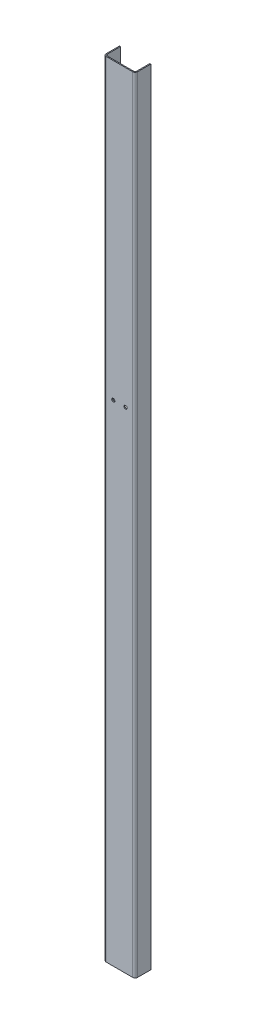
ISO-10303-21;
HEADER;
FILE_DESCRIPTION(('STEP AP214'),'2;1');
FILE_NAME('part.step','',(''),(''),'','','');
FILE_SCHEMA(('AUTOMOTIVE_DESIGN { 1 0 10303 214 1 1 1 1 }'));
ENDSEC;
DATA;
#1=APPLICATION_CONTEXT('core data for automotive mechanical design processes');
#2=APPLICATION_PROTOCOL_DEFINITION('international standard','automotive_design',2000,#1);
#3=PRODUCT_CONTEXT('',#1,'mechanical');
#4=PRODUCT('Part','Part','',(#3));
#5=PRODUCT_RELATED_PRODUCT_CATEGORY('part','',(#4));
#6=PRODUCT_DEFINITION_FORMATION('','',#4);
#7=PRODUCT_DEFINITION_CONTEXT('part definition',#1,'design');
#8=PRODUCT_DEFINITION('design','',#6,#7);
#9=PRODUCT_DEFINITION_SHAPE('','',#8);
#10=(LENGTH_UNIT() NAMED_UNIT(*) SI_UNIT(.MILLI.,.METRE.));
#11=(NAMED_UNIT(*) PLANE_ANGLE_UNIT() SI_UNIT($,.RADIAN.));
#12=(NAMED_UNIT(*) SI_UNIT($,.STERADIAN.) SOLID_ANGLE_UNIT());
#13=UNCERTAINTY_MEASURE_WITH_UNIT(LENGTH_MEASURE(1.E-05),#10,'distance_accuracy_value','');
#14=(GEOMETRIC_REPRESENTATION_CONTEXT(3) GLOBAL_UNCERTAINTY_ASSIGNED_CONTEXT((#13)) GLOBAL_UNIT_ASSIGNED_CONTEXT((#10,
#11,#12)) REPRESENTATION_CONTEXT('',''));
#15=CARTESIAN_POINT('',(0.,0.,0.));
#16=DIRECTION('',(0.,0.,1.));
#17=DIRECTION('',(1.,0.,0.));
#18=AXIS2_PLACEMENT_3D('',#15,#16,#17);
#19=CARTESIAN_POINT('',(-32.,800.,-30.));
#20=DIRECTION('',(1.,0.,0.));
#21=DIRECTION('',(0.,0.,-1.));
#22=AXIS2_PLACEMENT_3D('',#19,#20,#21);
#23=PLANE('',#22);
#24=CARTESIAN_POINT('',(-32.,350.,-14.9999999999999));
#25=DIRECTION('',(-1.,0.,0.));
#26=DIRECTION('',(0.,0.,1.));
#27=AXIS2_PLACEMENT_3D('',#24,#25,#26);
#28=CIRCLE('',#27,2.74999999999997);
#29=CARTESIAN_POINT('',(-32.,350.,-12.2499999999999));
#30=VERTEX_POINT('',#29);
#31=EDGE_CURVE('E291',#30,#30,#28,.T.);
#32=ORIENTED_EDGE('',*,*,#31,.F.);
#33=EDGE_LOOP('',(#32));
#34=FACE_BOUND('',#33,.T.);
#35=CARTESIAN_POINT('',(-32.,0.,-15.));
#36=DIRECTION('',(-1.,0.,0.));
#37=DIRECTION('',(0.,0.,1.));
#38=AXIS2_PLACEMENT_3D('',#35,#36,#37);
#39=CIRCLE('',#38,2.74999999999999);
#40=CARTESIAN_POINT('',(-32.,0.,-12.25));
#41=VERTEX_POINT('',#40);
#42=EDGE_CURVE('E285',#41,#41,#39,.T.);
#43=ORIENTED_EDGE('',*,*,#42,.F.);
#44=EDGE_LOOP('',(#43));
#45=FACE_BOUND('',#44,.T.);
#46=CARTESIAN_POINT('',(-32.,-350.,-14.9999999999999));
#47=DIRECTION('',(-1.,0.,0.));
#48=DIRECTION('',(0.,0.,1.));
#49=AXIS2_PLACEMENT_3D('',#46,#47,#48);
#50=CIRCLE('',#49,2.74999999999997);
#51=CARTESIAN_POINT('',(-32.,-350.,-12.2499999999999));
#52=VERTEX_POINT('',#51);
#53=EDGE_CURVE('E279',#52,#52,#50,.T.);
#54=ORIENTED_EDGE('',*,*,#53,.F.);
#55=EDGE_LOOP('',(#54));
#56=FACE_BOUND('',#55,.T.);
#57=CARTESIAN_POINT('',(-32.,-700.,-14.9999999999999));
#58=DIRECTION('',(-1.,0.,0.));
#59=DIRECTION('',(0.,0.,1.));
#60=AXIS2_PLACEMENT_3D('',#57,#58,#59);
#61=CIRCLE('',#60,2.75000000000003);
#62=CARTESIAN_POINT('',(-32.,-700.,-12.2499999999998));
#63=VERTEX_POINT('',#62);
#64=EDGE_CURVE('E273',#63,#63,#61,.T.);
#65=ORIENTED_EDGE('',*,*,#64,.F.);
#66=EDGE_LOOP('',(#65));
#67=FACE_BOUND('',#66,.T.);
#68=DIRECTION('',(0.,0.,1.));
#69=VECTOR('',#68,1.);
#70=CARTESIAN_POINT('',(-32.,-800.,-30.));
#71=LINE('',#70,#69);
#72=CARTESIAN_POINT('',(-32.,-800.,-30.));
#73=VERTEX_POINT('',#72);
#74=CARTESIAN_POINT('',(-32.,-800.,-3.00000000000003));
#75=VERTEX_POINT('',#74);
#76=EDGE_CURVE('E198',#73,#75,#71,.T.);
#77=ORIENTED_EDGE('',*,*,#76,.T.);
#78=DIRECTION('',(0.,-1.,0.));
#79=VECTOR('',#78,1.);
#80=CARTESIAN_POINT('',(-32.,800.,-3.00000000000003));
#81=LINE('',#80,#79);
#82=CARTESIAN_POINT('',(-32.,800.,-3.00000000000003));
#83=VERTEX_POINT('',#82);
#84=EDGE_CURVE('E163',#83,#75,#81,.T.);
#85=ORIENTED_EDGE('',*,*,#84,.F.);
#86=DIRECTION('',(0.,0.,1.));
#87=VECTOR('',#86,1.);
#88=CARTESIAN_POINT('',(-32.,800.,-30.));
#89=LINE('',#88,#87);
#90=CARTESIAN_POINT('',(-32.,800.,-30.));
#91=VERTEX_POINT('',#90);
#92=EDGE_CURVE('E154',#91,#83,#89,.T.);
#93=ORIENTED_EDGE('',*,*,#92,.F.);
#94=DIRECTION('',(0.,-1.,0.));
#95=VECTOR('',#94,1.);
#96=CARTESIAN_POINT('',(-32.,800.,-30.));
#97=LINE('',#96,#95);
#98=EDGE_CURVE('E210',#91,#73,#97,.T.);
#99=ORIENTED_EDGE('',*,*,#98,.T.);
#100=EDGE_LOOP('',(#77,#85,#93,#99));
#101=FACE_BOUND('',#100,.T.);
#102=CARTESIAN_POINT('',(-32.,700.,-14.9999999999999));
#103=DIRECTION('',(-1.,0.,0.));
#104=DIRECTION('',(0.,0.,1.));
#105=AXIS2_PLACEMENT_3D('',#102,#103,#104);
#106=CIRCLE('',#105,2.75000000000003);
#107=CARTESIAN_POINT('',(-32.,700.,-12.2499999999998));
#108=VERTEX_POINT('',#107);
#109=EDGE_CURVE('E297',#108,#108,#106,.T.);
#110=ORIENTED_EDGE('',*,*,#109,.F.);
#111=EDGE_LOOP('',(#110));
#112=FACE_BOUND('',#111,.T.);
#113=ADVANCED_FACE('F39',(#34,#45,#56,#67,#101,#112),#23,.F.);
#114=CARTESIAN_POINT('',(-27.,800.,0.));
#115=DIRECTION('',(0.,1.,0.));
#116=DIRECTION('',(0.,0.,1.));
#117=AXIS2_PLACEMENT_3D('',#114,#115,#116);
#118=PLANE('',#117);
#119=DIRECTION('',(0.,0.,1.));
#120=VECTOR('',#119,1.);
#121=CARTESIAN_POINT('',(-27.,800.,0.));
#122=LINE('',#121,#120);
#123=CARTESIAN_POINT('',(-27.,800.,0.));
#124=VERTEX_POINT('',#123);
#125=CARTESIAN_POINT('',(-27.,800.,2.));
#126=VERTEX_POINT('',#125);
#127=EDGE_CURVE('E11',#124,#126,#122,.T.);
#128=ORIENTED_EDGE('',*,*,#127,.F.);
#129=CARTESIAN_POINT('',(-27.,800.,-3.));
#130=DIRECTION('',(0.,1.,0.));
#131=DIRECTION('',(0.,0.,1.));
#132=AXIS2_PLACEMENT_3D('',#129,#130,#131);
#133=CIRCLE('',#132,3.);
#134=CARTESIAN_POINT('',(-30.,800.,-3.00000000000002));
#135=VERTEX_POINT('',#134);
#136=EDGE_CURVE('E251',#135,#124,#133,.T.);
#137=ORIENTED_EDGE('',*,*,#136,.F.);
#138=DIRECTION('',(1.,0.,0.));
#139=VECTOR('',#138,1.);
#140=CARTESIAN_POINT('',(-32.,800.,-3.00000000000003));
#141=LINE('',#140,#139);
#142=EDGE_CURVE('E48',#83,#135,#141,.T.);
#143=ORIENTED_EDGE('',*,*,#142,.F.);
#144=CARTESIAN_POINT('',(-27.,800.,-3.));
#145=DIRECTION('',(0.,1.,0.));
#146=DIRECTION('',(1.,0.,0.));
#147=AXIS2_PLACEMENT_3D('',#144,#145,#146);
#148=CIRCLE('',#147,5.);
#149=EDGE_CURVE('E149',#83,#126,#148,.T.);
#150=ORIENTED_EDGE('',*,*,#149,.T.);
#151=EDGE_LOOP('',(#128,#137,#143,#150));
#152=FACE_BOUND('',#151,.T.);
#153=ADVANCED_FACE('F41',(#152),#118,.T.);
#154=CARTESIAN_POINT('',(-32.,800.,-3.00000000000003));
#155=DIRECTION('',(0.,1.,0.));
#156=DIRECTION('',(0.,0.,1.));
#157=AXIS2_PLACEMENT_3D('',#154,#155,#156);
#158=PLANE('',#157);
#159=DIRECTION('',(1.,0.,0.));
#160=VECTOR('',#159,1.);
#161=CARTESIAN_POINT('',(-27.,800.,0.));
#162=LINE('',#161,#160);
#163=CARTESIAN_POINT('',(27.,800.,0.));
#164=VERTEX_POINT('',#163);
#165=EDGE_CURVE('E143',#124,#164,#162,.T.);
#166=ORIENTED_EDGE('',*,*,#165,.F.);
#167=ORIENTED_EDGE('',*,*,#127,.T.);
#168=DIRECTION('',(1.,0.,0.));
#169=VECTOR('',#168,1.);
#170=CARTESIAN_POINT('',(-27.,800.,2.));
#171=LINE('',#170,#169);
#172=CARTESIAN_POINT('',(27.,800.,1.99999999999999));
#173=VERTEX_POINT('',#172);
#174=EDGE_CURVE('E140',#126,#173,#171,.T.);
#175=ORIENTED_EDGE('',*,*,#174,.T.);
#176=DIRECTION('',(0.,0.,-1.));
#177=VECTOR('',#176,1.);
#178=CARTESIAN_POINT('',(27.,800.,1.99999999999999));
#179=LINE('',#178,#177);
#180=EDGE_CURVE('E232',#173,#164,#179,.T.);
#181=ORIENTED_EDGE('',*,*,#180,.T.);
#182=EDGE_LOOP('',(#166,#167,#175,#181));
#183=FACE_BOUND('',#182,.T.);
#184=ADVANCED_FACE('F138',(#183),#158,.T.);
#185=CARTESIAN_POINT('',(-30.,-800.,-3.00000000000002));
#186=DIRECTION('',(0.,-1.,0.));
#187=DIRECTION('',(0.,0.,-1.));
#188=AXIS2_PLACEMENT_3D('',#185,#186,#187);
#189=PLANE('',#188);
#190=DIRECTION('',(-1.,0.,0.));
#191=VECTOR('',#190,1.);
#192=CARTESIAN_POINT('',(-30.,-800.,-3.00000000000002));
#193=LINE('',#192,#191);
#194=CARTESIAN_POINT('',(-30.,-800.,-3.00000000000002));
#195=VERTEX_POINT('',#194);
#196=EDGE_CURVE('E237',#195,#75,#193,.T.);
#197=ORIENTED_EDGE('',*,*,#196,.F.);
#198=CARTESIAN_POINT('',(-27.,-800.,-3.));
#199=DIRECTION('',(0.,1.,0.));
#200=DIRECTION('',(0.,0.,1.));
#201=AXIS2_PLACEMENT_3D('',#198,#199,#200);
#202=CIRCLE('',#201,3.);
#203=CARTESIAN_POINT('',(-27.,-800.,0.));
#204=VERTEX_POINT('',#203);
#205=EDGE_CURVE('E189',#195,#204,#202,.T.);
#206=ORIENTED_EDGE('',*,*,#205,.T.);
#207=DIRECTION('',(0.,0.,-1.));
#208=VECTOR('',#207,1.);
#209=CARTESIAN_POINT('',(-27.,-800.,2.));
#210=LINE('',#209,#208);
#211=CARTESIAN_POINT('',(-27.,-800.,2.));
#212=VERTEX_POINT('',#211);
#213=EDGE_CURVE('E235',#212,#204,#210,.T.);
#214=ORIENTED_EDGE('',*,*,#213,.F.);
#215=CARTESIAN_POINT('',(-27.,-800.,-3.));
#216=DIRECTION('',(0.,1.,0.));
#217=DIRECTION('',(1.,0.,0.));
#218=AXIS2_PLACEMENT_3D('',#215,#216,#217);
#219=CIRCLE('',#218,5.);
#220=EDGE_CURVE('E161',#75,#212,#219,.T.);
#221=ORIENTED_EDGE('',*,*,#220,.F.);
#222=EDGE_LOOP('',(#197,#206,#214,#221));
#223=FACE_BOUND('',#222,.T.);
#224=ADVANCED_FACE('F326',(#223),#189,.T.);
#225=CARTESIAN_POINT('',(-27.,-800.,2.));
#226=DIRECTION('',(0.,-1.,0.));
#227=DIRECTION('',(0.,0.,-1.));
#228=AXIS2_PLACEMENT_3D('',#225,#226,#227);
#229=PLANE('',#228);
#230=DIRECTION('',(0.,0.,1.));
#231=VECTOR('',#230,1.);
#232=CARTESIAN_POINT('',(-30.,-800.,-30.));
#233=LINE('',#232,#231);
#234=CARTESIAN_POINT('',(-30.,-800.,-30.));
#235=VERTEX_POINT('',#234);
#236=EDGE_CURVE('E192',#235,#195,#233,.T.);
#237=ORIENTED_EDGE('',*,*,#236,.T.);
#238=ORIENTED_EDGE('',*,*,#196,.T.);
#239=ORIENTED_EDGE('',*,*,#76,.F.);
#240=DIRECTION('',(1.,0.,0.));
#241=VECTOR('',#240,1.);
#242=CARTESIAN_POINT('',(-32.,-800.,-30.));
#243=LINE('',#242,#241);
#244=EDGE_CURVE('E195',#73,#235,#243,.T.);
#245=ORIENTED_EDGE('',*,*,#244,.T.);
#246=EDGE_LOOP('',(#237,#238,#239,#245));
#247=FACE_BOUND('',#246,.T.);
#248=ADVANCED_FACE('F329',(#247),#229,.T.);
#249=CARTESIAN_POINT('',(30.,800.,-3.00000000000003));
#250=DIRECTION('',(0.,1.,0.));
#251=DIRECTION('',(0.,0.,1.));
#252=AXIS2_PLACEMENT_3D('',#249,#250,#251);
#253=PLANE('',#252);
#254=DIRECTION('',(1.,0.,0.));
#255=VECTOR('',#254,1.);
#256=CARTESIAN_POINT('',(30.,800.,-3.00000000000003));
#257=LINE('',#256,#255);
#258=CARTESIAN_POINT('',(30.,800.,-3.00000000000003));
#259=VERTEX_POINT('',#258);
#260=CARTESIAN_POINT('',(32.,800.,-3.00000000000003));
#261=VERTEX_POINT('',#260);
#262=EDGE_CURVE('E56',#259,#261,#257,.T.);
#263=ORIENTED_EDGE('',*,*,#262,.F.);
#264=CARTESIAN_POINT('',(27.,800.,-3.00000000000001));
#265=DIRECTION('',(0.,1.,0.));
#266=DIRECTION('',(0.,0.,1.));
#267=AXIS2_PLACEMENT_3D('',#264,#265,#266);
#268=CIRCLE('',#267,3.);
#269=EDGE_CURVE('E261',#164,#259,#268,.T.);
#270=ORIENTED_EDGE('',*,*,#269,.F.);
#271=ORIENTED_EDGE('',*,*,#180,.F.);
#272=CARTESIAN_POINT('',(27.,800.,-3.00000000000001));
#273=DIRECTION('',(0.,1.,0.));
#274=DIRECTION('',(1.,0.,0.));
#275=AXIS2_PLACEMENT_3D('',#272,#273,#274);
#276=CIRCLE('',#275,5.);
#277=EDGE_CURVE('E169',#173,#261,#276,.T.);
#278=ORIENTED_EDGE('',*,*,#277,.T.);
#279=EDGE_LOOP('',(#263,#270,#271,#278));
#280=FACE_BOUND('',#279,.T.);
#281=ADVANCED_FACE('F534',(#280),#253,.T.);
#282=CARTESIAN_POINT('',(27.,800.,1.99999999999999));
#283=DIRECTION('',(0.,1.,0.));
#284=DIRECTION('',(0.,0.,1.));
#285=AXIS2_PLACEMENT_3D('',#282,#283,#284);
#286=PLANE('',#285);
#287=DIRECTION('',(0.,0.,-1.));
#288=VECTOR('',#287,1.);
#289=CARTESIAN_POINT('',(30.,800.,-3.00000000000003));
#290=LINE('',#289,#288);
#291=CARTESIAN_POINT('',(30.,800.,-30.));
#292=VERTEX_POINT('',#291);
#293=EDGE_CURVE('E264',#259,#292,#290,.T.);
#294=ORIENTED_EDGE('',*,*,#293,.F.);
#295=ORIENTED_EDGE('',*,*,#262,.T.);
#296=DIRECTION('',(0.,0.,-1.));
#297=VECTOR('',#296,1.);
#298=CARTESIAN_POINT('',(32.,800.,-3.00000000000003));
#299=LINE('',#298,#297);
#300=CARTESIAN_POINT('',(32.,800.,-30.));
#301=VERTEX_POINT('',#300);
#302=EDGE_CURVE('E110',#261,#301,#299,.T.);
#303=ORIENTED_EDGE('',*,*,#302,.T.);
#304=DIRECTION('',(1.,0.,0.));
#305=VECTOR('',#304,1.);
#306=CARTESIAN_POINT('',(30.,800.,-30.));
#307=LINE('',#306,#305);
#308=EDGE_CURVE('E267',#292,#301,#307,.T.);
#309=ORIENTED_EDGE('',*,*,#308,.F.);
#310=EDGE_LOOP('',(#294,#295,#303,#309));
#311=FACE_BOUND('',#310,.T.);
#312=ADVANCED_FACE('F524',(#311),#286,.T.);
#313=CARTESIAN_POINT('',(27.,-800.,0.));
#314=DIRECTION('',(0.,-1.,0.));
#315=DIRECTION('',(0.,0.,-1.));
#316=AXIS2_PLACEMENT_3D('',#313,#314,#315);
#317=PLANE('',#316);
#318=DIRECTION('',(0.,0.,1.));
#319=VECTOR('',#318,1.);
#320=CARTESIAN_POINT('',(27.,-800.,0.));
#321=LINE('',#320,#319);
#322=CARTESIAN_POINT('',(27.,-800.,0.));
#323=VERTEX_POINT('',#322);
#324=CARTESIAN_POINT('',(27.,-800.,1.99999999999999));
#325=VERTEX_POINT('',#324);
#326=EDGE_CURVE('E97',#323,#325,#321,.T.);
#327=ORIENTED_EDGE('',*,*,#326,.F.);
#328=CARTESIAN_POINT('',(27.,-800.,-3.00000000000001));
#329=DIRECTION('',(0.,1.,0.));
#330=DIRECTION('',(0.,0.,1.));
#331=AXIS2_PLACEMENT_3D('',#328,#329,#330);
#332=CIRCLE('',#331,3.);
#333=CARTESIAN_POINT('',(30.,-800.,-3.00000000000003));
#334=VERTEX_POINT('',#333);
#335=EDGE_CURVE('E185',#323,#334,#332,.T.);
#336=ORIENTED_EDGE('',*,*,#335,.T.);
#337=DIRECTION('',(-1.,0.,0.));
#338=VECTOR('',#337,1.);
#339=CARTESIAN_POINT('',(32.,-800.,-3.00000000000003));
#340=LINE('',#339,#338);
#341=CARTESIAN_POINT('',(32.,-800.,-3.00000000000003));
#342=VERTEX_POINT('',#341);
#343=EDGE_CURVE('E104',#342,#334,#340,.T.);
#344=ORIENTED_EDGE('',*,*,#343,.F.);
#345=CARTESIAN_POINT('',(27.,-800.,-3.00000000000001));
#346=DIRECTION('',(0.,1.,0.));
#347=DIRECTION('',(1.,0.,0.));
#348=AXIS2_PLACEMENT_3D('',#345,#346,#347);
#349=CIRCLE('',#348,5.);
#350=EDGE_CURVE('E204',#325,#342,#349,.T.);
#351=ORIENTED_EDGE('',*,*,#350,.F.);
#352=EDGE_LOOP('',(#327,#336,#344,#351));
#353=FACE_BOUND('',#352,.T.);
#354=ADVANCED_FACE('F514',(#353),#317,.T.);
#355=CARTESIAN_POINT('',(32.,-800.,-3.00000000000003));
#356=DIRECTION('',(0.,-1.,0.));
#357=DIRECTION('',(0.,0.,-1.));
#358=AXIS2_PLACEMENT_3D('',#355,#356,#357);
#359=PLANE('',#358);
#360=DIRECTION('',(1.,0.,0.));
#361=VECTOR('',#360,1.);
#362=CARTESIAN_POINT('',(-27.,-800.,0.));
#363=LINE('',#362,#361);
#364=EDGE_CURVE('E187',#204,#323,#363,.T.);
#365=ORIENTED_EDGE('',*,*,#364,.T.);
#366=ORIENTED_EDGE('',*,*,#326,.T.);
#367=DIRECTION('',(1.,0.,0.));
#368=VECTOR('',#367,1.);
#369=CARTESIAN_POINT('',(-27.,-800.,2.));
#370=LINE('',#369,#368);
#371=EDGE_CURVE('E202',#212,#325,#370,.T.);
#372=ORIENTED_EDGE('',*,*,#371,.F.);
#373=ORIENTED_EDGE('',*,*,#213,.T.);
#374=EDGE_LOOP('',(#365,#366,#372,#373));
#375=FACE_BOUND('',#374,.T.);
#376=ADVANCED_FACE('F503',(#375),#359,.T.);
#377=CARTESIAN_POINT('',(32.,800.,-3.00000000000003));
#378=DIRECTION('',(-1.,0.,0.));
#379=DIRECTION('',(0.,0.,1.));
#380=AXIS2_PLACEMENT_3D('',#377,#378,#379);
#381=PLANE('',#380);
#382=DIRECTION('',(0.,0.,-1.));
#383=VECTOR('',#382,1.);
#384=CARTESIAN_POINT('',(32.,-800.,-3.00000000000003));
#385=LINE('',#384,#383);
#386=CARTESIAN_POINT('',(32.,-800.,-30.));
#387=VERTEX_POINT('',#386);
#388=EDGE_CURVE('E175',#342,#387,#385,.T.);
#389=ORIENTED_EDGE('',*,*,#388,.T.);
#390=DIRECTION('',(0.,-1.,0.));
#391=VECTOR('',#390,1.);
#392=CARTESIAN_POINT('',(32.,800.,-30.));
#393=LINE('',#392,#391);
#394=EDGE_CURVE('E228',#301,#387,#393,.T.);
#395=ORIENTED_EDGE('',*,*,#394,.F.);
#396=ORIENTED_EDGE('',*,*,#302,.F.);
#397=DIRECTION('',(0.,-1.,0.));
#398=VECTOR('',#397,1.);
#399=CARTESIAN_POINT('',(32.,800.,-3.00000000000003));
#400=LINE('',#399,#398);
#401=EDGE_CURVE('E171',#261,#342,#400,.T.);
#402=ORIENTED_EDGE('',*,*,#401,.T.);
#403=EDGE_LOOP('',(#389,#395,#396,#402));
#404=FACE_BOUND('',#403,.T.);
#405=ADVANCED_FACE('F492',(#404),#381,.F.);
#406=CARTESIAN_POINT('',(30.,800.,-30.));
#407=DIRECTION('',(0.,0.,-1.));
#408=DIRECTION('',(-1.,0.,0.));
#409=AXIS2_PLACEMENT_3D('',#406,#407,#408);
#410=PLANE('',#409);
#411=DIRECTION('',(1.,0.,0.));
#412=VECTOR('',#411,1.);
#413=CARTESIAN_POINT('',(30.,-800.,-30.));
#414=LINE('',#413,#412);
#415=CARTESIAN_POINT('',(30.,-800.,-30.));
#416=VERTEX_POINT('',#415);
#417=EDGE_CURVE('E178',#416,#387,#414,.T.);
#418=ORIENTED_EDGE('',*,*,#417,.F.);
#419=DIRECTION('',(0.,-1.,0.));
#420=VECTOR('',#419,1.);
#421=CARTESIAN_POINT('',(30.,800.,-30.));
#422=LINE('',#421,#420);
#423=EDGE_CURVE('E226',#292,#416,#422,.T.);
#424=ORIENTED_EDGE('',*,*,#423,.F.);
#425=ORIENTED_EDGE('',*,*,#308,.T.);
#426=ORIENTED_EDGE('',*,*,#394,.T.);
#427=EDGE_LOOP('',(#418,#424,#425,#426));
#428=FACE_BOUND('',#427,.T.);
#429=ADVANCED_FACE('F481',(#428),#410,.T.);
#430=CARTESIAN_POINT('',(30.,800.,-3.00000000000003));
#431=DIRECTION('',(-1.,0.,0.));
#432=DIRECTION('',(0.,0.,1.));
#433=AXIS2_PLACEMENT_3D('',#430,#431,#432);
#434=PLANE('',#433);
#435=DIRECTION('',(0.,0.,-1.));
#436=VECTOR('',#435,1.);
#437=CARTESIAN_POINT('',(30.,-800.,-3.00000000000003));
#438=LINE('',#437,#436);
#439=EDGE_CURVE('E182',#334,#416,#438,.T.);
#440=ORIENTED_EDGE('',*,*,#439,.F.);
#441=DIRECTION('',(0.,-1.,0.));
#442=VECTOR('',#441,1.);
#443=CARTESIAN_POINT('',(30.,800.,-3.00000000000003));
#444=LINE('',#443,#442);
#445=EDGE_CURVE('E223',#259,#334,#444,.T.);
#446=ORIENTED_EDGE('',*,*,#445,.F.);
#447=ORIENTED_EDGE('',*,*,#293,.T.);
#448=ORIENTED_EDGE('',*,*,#423,.T.);
#449=EDGE_LOOP('',(#440,#446,#447,#448));
#450=FACE_BOUND('',#449,.T.);
#451=ADVANCED_FACE('F470',(#450),#434,.T.);
#452=CARTESIAN_POINT('',(27.,800.,-3.00000000000001));
#453=DIRECTION('',(0.,-1.,0.));
#454=DIRECTION('',(0.,0.,-1.));
#455=AXIS2_PLACEMENT_3D('',#452,#453,#454);
#456=CYLINDRICAL_SURFACE('',#455,3.);
#457=ORIENTED_EDGE('',*,*,#335,.F.);
#458=DIRECTION('',(0.,-1.,0.));
#459=VECTOR('',#458,1.);
#460=CARTESIAN_POINT('',(27.,800.,0.));
#461=LINE('',#460,#459);
#462=EDGE_CURVE('E220',#164,#323,#461,.T.);
#463=ORIENTED_EDGE('',*,*,#462,.F.);
#464=ORIENTED_EDGE('',*,*,#269,.T.);
#465=ORIENTED_EDGE('',*,*,#445,.T.);
#466=EDGE_LOOP('',(#457,#463,#464,#465));
#467=FACE_BOUND('',#466,.T.);
#468=ADVANCED_FACE('F318',(#467),#456,.F.);
#469=CARTESIAN_POINT('',(-27.,800.,0.));
#470=DIRECTION('',(0.,0.,-1.));
#471=DIRECTION('',(-1.,0.,0.));
#472=AXIS2_PLACEMENT_3D('',#469,#470,#471);
#473=PLANE('',#472);
#474=CARTESIAN_POINT('',(-12.5000000000001,200.,0.));
#475=DIRECTION('',(0.,0.,-1.));
#476=DIRECTION('',(-1.,0.,0.));
#477=AXIS2_PLACEMENT_3D('',#474,#475,#476);
#478=CIRCLE('',#477,3.24999999999999);
#479=CARTESIAN_POINT('',(-15.7500000000001,200.,0.));
#480=VERTEX_POINT('',#479);
#481=EDGE_CURVE('E309',#480,#480,#478,.T.);
#482=ORIENTED_EDGE('',*,*,#481,.F.);
#483=EDGE_LOOP('',(#482));
#484=FACE_BOUND('',#483,.T.);
#485=CARTESIAN_POINT('',(12.4999999999999,200.,0.));
#486=DIRECTION('',(0.,0.,-1.));
#487=DIRECTION('',(-1.,0.,0.));
#488=AXIS2_PLACEMENT_3D('',#485,#486,#487);
#489=CIRCLE('',#488,3.24999999999999);
#490=CARTESIAN_POINT('',(9.24999999999994,200.,0.));
#491=VERTEX_POINT('',#490);
#492=EDGE_CURVE('E303',#491,#491,#489,.T.);
#493=ORIENTED_EDGE('',*,*,#492,.F.);
#494=EDGE_LOOP('',(#493));
#495=FACE_BOUND('',#494,.T.);
#496=ORIENTED_EDGE('',*,*,#364,.F.);
#497=DIRECTION('',(0.,-1.,0.));
#498=VECTOR('',#497,1.);
#499=CARTESIAN_POINT('',(-27.,800.,0.));
#500=LINE('',#499,#498);
#501=EDGE_CURVE('E217',#124,#204,#500,.T.);
#502=ORIENTED_EDGE('',*,*,#501,.F.);
#503=ORIENTED_EDGE('',*,*,#165,.T.);
#504=ORIENTED_EDGE('',*,*,#462,.T.);
#505=EDGE_LOOP('',(#496,#502,#503,#504));
#506=FACE_BOUND('',#505,.T.);
#507=ADVANCED_FACE('F315',(#484,#495,#506),#473,.T.);
#508=CARTESIAN_POINT('',(-27.,800.,-3.));
#509=DIRECTION('',(0.,-1.,0.));
#510=DIRECTION('',(0.,0.,-1.));
#511=AXIS2_PLACEMENT_3D('',#508,#509,#510);
#512=CYLINDRICAL_SURFACE('',#511,3.);
#513=ORIENTED_EDGE('',*,*,#205,.F.);
#514=DIRECTION('',(0.,-1.,0.));
#515=VECTOR('',#514,1.);
#516=CARTESIAN_POINT('',(-30.,800.,-3.00000000000002));
#517=LINE('',#516,#515);
#518=EDGE_CURVE('E214',#135,#195,#517,.T.);
#519=ORIENTED_EDGE('',*,*,#518,.F.);
#520=ORIENTED_EDGE('',*,*,#136,.T.);
#521=ORIENTED_EDGE('',*,*,#501,.T.);
#522=EDGE_LOOP('',(#513,#519,#520,#521));
#523=FACE_BOUND('',#522,.T.);
#524=ADVANCED_FACE('F250',(#523),#512,.F.);
#525=CARTESIAN_POINT('',(-30.,800.,-30.));
#526=DIRECTION('',(1.,0.,0.));
#527=DIRECTION('',(0.,0.,-1.));
#528=AXIS2_PLACEMENT_3D('',#525,#526,#527);
#529=PLANE('',#528);
#530=CARTESIAN_POINT('',(-30.,700.,-14.9999999999999));
#531=DIRECTION('',(1.,0.,0.));
#532=DIRECTION('',(0.,0.,-1.));
#533=AXIS2_PLACEMENT_3D('',#530,#531,#532);
#534=CIRCLE('',#533,2.75000000000003);
#535=CARTESIAN_POINT('',(-30.,700.,-17.7499999999999));
#536=VERTEX_POINT('',#535);
#537=EDGE_CURVE('E294',#536,#536,#534,.T.);
#538=ORIENTED_EDGE('',*,*,#537,.F.);
#539=EDGE_LOOP('',(#538));
#540=FACE_BOUND('',#539,.T.);
#541=CARTESIAN_POINT('',(-30.,350.,-14.9999999999999));
#542=DIRECTION('',(1.,0.,0.));
#543=DIRECTION('',(0.,0.,-1.));
#544=AXIS2_PLACEMENT_3D('',#541,#542,#543);
#545=CIRCLE('',#544,2.74999999999997);
#546=CARTESIAN_POINT('',(-30.,350.,-17.7499999999999));
#547=VERTEX_POINT('',#546);
#548=EDGE_CURVE('E288',#547,#547,#545,.T.);
#549=ORIENTED_EDGE('',*,*,#548,.F.);
#550=EDGE_LOOP('',(#549));
#551=FACE_BOUND('',#550,.T.);
#552=CARTESIAN_POINT('',(-30.,0.,-15.));
#553=DIRECTION('',(1.,0.,0.));
#554=DIRECTION('',(0.,0.,-1.));
#555=AXIS2_PLACEMENT_3D('',#552,#553,#554);
#556=CIRCLE('',#555,2.74999999999999);
#557=CARTESIAN_POINT('',(-30.,0.,-17.75));
#558=VERTEX_POINT('',#557);
#559=EDGE_CURVE('E282',#558,#558,#556,.T.);
#560=ORIENTED_EDGE('',*,*,#559,.F.);
#561=EDGE_LOOP('',(#560));
#562=FACE_BOUND('',#561,.T.);
#563=CARTESIAN_POINT('',(-30.,-350.,-14.9999999999999));
#564=DIRECTION('',(1.,0.,0.));
#565=DIRECTION('',(0.,0.,-1.));
#566=AXIS2_PLACEMENT_3D('',#563,#564,#565);
#567=CIRCLE('',#566,2.74999999999997);
#568=CARTESIAN_POINT('',(-30.,-350.,-17.7499999999999));
#569=VERTEX_POINT('',#568);
#570=EDGE_CURVE('E276',#569,#569,#567,.T.);
#571=ORIENTED_EDGE('',*,*,#570,.F.);
#572=EDGE_LOOP('',(#571));
#573=FACE_BOUND('',#572,.T.);
#574=CARTESIAN_POINT('',(-30.,-700.,-14.9999999999999));
#575=DIRECTION('',(1.,0.,0.));
#576=DIRECTION('',(0.,0.,-1.));
#577=AXIS2_PLACEMENT_3D('',#574,#575,#576);
#578=CIRCLE('',#577,2.75000000000003);
#579=CARTESIAN_POINT('',(-30.,-700.,-17.7499999999999));
#580=VERTEX_POINT('',#579);
#581=EDGE_CURVE('E179',#580,#580,#578,.T.);
#582=ORIENTED_EDGE('',*,*,#581,.F.);
#583=EDGE_LOOP('',(#582));
#584=FACE_BOUND('',#583,.T.);
#585=ORIENTED_EDGE('',*,*,#236,.F.);
#586=DIRECTION('',(0.,-1.,0.));
#587=VECTOR('',#586,1.);
#588=CARTESIAN_POINT('',(-30.,800.,-30.));
#589=LINE('',#588,#587);
#590=CARTESIAN_POINT('',(-30.,800.,-30.));
#591=VERTEX_POINT('',#590);
#592=EDGE_CURVE('E212',#591,#235,#589,.T.);
#593=ORIENTED_EDGE('',*,*,#592,.F.);
#594=DIRECTION('',(0.,0.,1.));
#595=VECTOR('',#594,1.);
#596=CARTESIAN_POINT('',(-30.,800.,-30.));
#597=LINE('',#596,#595);
#598=EDGE_CURVE('E244',#591,#135,#597,.T.);
#599=ORIENTED_EDGE('',*,*,#598,.T.);
#600=ORIENTED_EDGE('',*,*,#518,.T.);
#601=EDGE_LOOP('',(#585,#593,#599,#600));
#602=FACE_BOUND('',#601,.T.);
#603=ADVANCED_FACE('F255',(#540,#551,#562,#573,#584,#602),#529,.T.);
#604=CARTESIAN_POINT('',(-32.,800.,-30.));
#605=DIRECTION('',(0.,0.,-1.));
#606=DIRECTION('',(-1.,0.,0.));
#607=AXIS2_PLACEMENT_3D('',#604,#605,#606);
#608=PLANE('',#607);
#609=ORIENTED_EDGE('',*,*,#244,.F.);
#610=ORIENTED_EDGE('',*,*,#98,.F.);
#611=DIRECTION('',(1.,0.,0.));
#612=VECTOR('',#611,1.);
#613=CARTESIAN_POINT('',(-32.,800.,-30.));
#614=LINE('',#613,#612);
#615=EDGE_CURVE('E256',#91,#591,#614,.T.);
#616=ORIENTED_EDGE('',*,*,#615,.T.);
#617=ORIENTED_EDGE('',*,*,#592,.T.);
#618=EDGE_LOOP('',(#609,#610,#616,#617));
#619=FACE_BOUND('',#618,.T.);
#620=ADVANCED_FACE('F334',(#619),#608,.T.);
#621=CARTESIAN_POINT('',(-27.,800.,-3.));
#622=DIRECTION('',(0.,-1.,0.));
#623=DIRECTION('',(0.,0.,-1.));
#624=AXIS2_PLACEMENT_3D('',#621,#622,#623);
#625=CYLINDRICAL_SURFACE('',#624,5.);
#626=ORIENTED_EDGE('',*,*,#220,.T.);
#627=DIRECTION('',(0.,-1.,0.));
#628=VECTOR('',#627,1.);
#629=CARTESIAN_POINT('',(-27.,800.,2.));
#630=LINE('',#629,#628);
#631=EDGE_CURVE('E158',#126,#212,#630,.T.);
#632=ORIENTED_EDGE('',*,*,#631,.F.);
#633=ORIENTED_EDGE('',*,*,#149,.F.);
#634=ORIENTED_EDGE('',*,*,#84,.T.);
#635=EDGE_LOOP('',(#626,#632,#633,#634));
#636=FACE_BOUND('',#635,.T.);
#637=ADVANCED_FACE('F159',(#636),#625,.T.);
#638=CARTESIAN_POINT('',(-27.,800.,2.));
#639=DIRECTION('',(0.,0.,-1.));
#640=DIRECTION('',(-1.,0.,0.));
#641=AXIS2_PLACEMENT_3D('',#638,#639,#640);
#642=PLANE('',#641);
#643=CARTESIAN_POINT('',(-12.5000000000001,200.,2.00000000000001));
#644=DIRECTION('',(0.,0.,-1.));
#645=DIRECTION('',(-1.,0.,0.));
#646=AXIS2_PLACEMENT_3D('',#643,#644,#645);
#647=CIRCLE('',#646,3.25);
#648=CARTESIAN_POINT('',(-15.7500000000001,200.,2.00000000000001));
#649=VERTEX_POINT('',#648);
#650=EDGE_CURVE('E306',#649,#649,#647,.T.);
#651=ORIENTED_EDGE('',*,*,#650,.T.);
#652=EDGE_LOOP('',(#651));
#653=FACE_BOUND('',#652,.T.);
#654=CARTESIAN_POINT('',(12.4999999999999,200.,2.));
#655=DIRECTION('',(0.,0.,-1.));
#656=DIRECTION('',(-1.,0.,0.));
#657=AXIS2_PLACEMENT_3D('',#654,#655,#656);
#658=CIRCLE('',#657,3.25);
#659=CARTESIAN_POINT('',(9.24999999999993,200.,2.));
#660=VERTEX_POINT('',#659);
#661=EDGE_CURVE('E300',#660,#660,#658,.T.);
#662=ORIENTED_EDGE('',*,*,#661,.T.);
#663=EDGE_LOOP('',(#662));
#664=FACE_BOUND('',#663,.T.);
#665=ORIENTED_EDGE('',*,*,#371,.T.);
#666=DIRECTION('',(0.,-1.,0.));
#667=VECTOR('',#666,1.);
#668=CARTESIAN_POINT('',(27.,800.,1.99999999999999));
#669=LINE('',#668,#667);
#670=EDGE_CURVE('E164',#173,#325,#669,.T.);
#671=ORIENTED_EDGE('',*,*,#670,.F.);
#672=ORIENTED_EDGE('',*,*,#174,.F.);
#673=ORIENTED_EDGE('',*,*,#631,.T.);
#674=EDGE_LOOP('',(#665,#671,#672,#673));
#675=FACE_BOUND('',#674,.T.);
#676=ADVANCED_FACE('F166',(#653,#664,#675),#642,.F.);
#677=CARTESIAN_POINT('',(27.,800.,-3.00000000000001));
#678=DIRECTION('',(0.,-1.,0.));
#679=DIRECTION('',(0.,0.,-1.));
#680=AXIS2_PLACEMENT_3D('',#677,#678,#679);
#681=CYLINDRICAL_SURFACE('',#680,5.);
#682=ORIENTED_EDGE('',*,*,#350,.T.);
#683=ORIENTED_EDGE('',*,*,#401,.F.);
#684=ORIENTED_EDGE('',*,*,#277,.F.);
#685=ORIENTED_EDGE('',*,*,#670,.T.);
#686=EDGE_LOOP('',(#682,#683,#684,#685));
#687=FACE_BOUND('',#686,.T.);
#688=ADVANCED_FACE('F355',(#687),#681,.T.);
#689=CARTESIAN_POINT('',(27.,800.,-3.00000000000001));
#690=DIRECTION('',(0.,1.,0.));
#691=DIRECTION('',(1.,0.,0.));
#692=AXIS2_PLACEMENT_3D('',#689,#690,#691);
#693=PLANE('',#692);
#694=ORIENTED_EDGE('',*,*,#92,.T.);
#695=ORIENTED_EDGE('',*,*,#142,.T.);
#696=ORIENTED_EDGE('',*,*,#598,.F.);
#697=ORIENTED_EDGE('',*,*,#615,.F.);
#698=EDGE_LOOP('',(#694,#695,#696,#697));
#699=FACE_BOUND('',#698,.T.);
#700=ADVANCED_FACE('F241',(#699),#693,.T.);
#701=CARTESIAN_POINT('',(27.,-800.,-3.00000000000001));
#702=DIRECTION('',(0.,1.,0.));
#703=DIRECTION('',(1.,0.,0.));
#704=AXIS2_PLACEMENT_3D('',#701,#702,#703);
#705=PLANE('',#704);
#706=ORIENTED_EDGE('',*,*,#388,.F.);
#707=ORIENTED_EDGE('',*,*,#343,.T.);
#708=ORIENTED_EDGE('',*,*,#439,.T.);
#709=ORIENTED_EDGE('',*,*,#417,.T.);
#710=EDGE_LOOP('',(#706,#707,#708,#709));
#711=FACE_BOUND('',#710,.T.);
#712=ADVANCED_FACE('F360',(#711),#705,.F.);
#713=CARTESIAN_POINT('',(-32.,-700.,-14.9999999999999));
#714=DIRECTION('',(-1.,0.,0.));
#715=DIRECTION('',(0.,0.,1.));
#716=AXIS2_PLACEMENT_3D('',#713,#714,#715);
#717=CYLINDRICAL_SURFACE('',#716,2.75000000000003);
#718=ORIENTED_EDGE('',*,*,#64,.T.);
#719=EDGE_LOOP('',(#718));
#720=FACE_BOUND('',#719,.T.);
#721=ORIENTED_EDGE('',*,*,#581,.T.);
#722=EDGE_LOOP('',(#721));
#723=FACE_BOUND('',#722,.T.);
#724=ADVANCED_FACE('F363',(#720,#723),#717,.F.);
#725=CARTESIAN_POINT('',(-32.,-350.,-14.9999999999999));
#726=DIRECTION('',(-1.,0.,0.));
#727=DIRECTION('',(0.,0.,1.));
#728=AXIS2_PLACEMENT_3D('',#725,#726,#727);
#729=CYLINDRICAL_SURFACE('',#728,2.74999999999997);
#730=ORIENTED_EDGE('',*,*,#53,.T.);
#731=EDGE_LOOP('',(#730));
#732=FACE_BOUND('',#731,.T.);
#733=ORIENTED_EDGE('',*,*,#570,.T.);
#734=EDGE_LOOP('',(#733));
#735=FACE_BOUND('',#734,.T.);
#736=ADVANCED_FACE('F369',(#732,#735),#729,.F.);
#737=CARTESIAN_POINT('',(-32.,0.,-15.));
#738=DIRECTION('',(-1.,0.,0.));
#739=DIRECTION('',(0.,0.,1.));
#740=AXIS2_PLACEMENT_3D('',#737,#738,#739);
#741=CYLINDRICAL_SURFACE('',#740,2.74999999999999);
#742=ORIENTED_EDGE('',*,*,#42,.T.);
#743=EDGE_LOOP('',(#742));
#744=FACE_BOUND('',#743,.T.);
#745=ORIENTED_EDGE('',*,*,#559,.T.);
#746=EDGE_LOOP('',(#745));
#747=FACE_BOUND('',#746,.T.);
#748=ADVANCED_FACE('F373',(#744,#747),#741,.F.);
#749=CARTESIAN_POINT('',(-32.,350.,-14.9999999999999));
#750=DIRECTION('',(-1.,0.,0.));
#751=DIRECTION('',(0.,0.,1.));
#752=AXIS2_PLACEMENT_3D('',#749,#750,#751);
#753=CYLINDRICAL_SURFACE('',#752,2.74999999999997);
#754=ORIENTED_EDGE('',*,*,#31,.T.);
#755=EDGE_LOOP('',(#754));
#756=FACE_BOUND('',#755,.T.);
#757=ORIENTED_EDGE('',*,*,#548,.T.);
#758=EDGE_LOOP('',(#757));
#759=FACE_BOUND('',#758,.T.);
#760=ADVANCED_FACE('F377',(#756,#759),#753,.F.);
#761=CARTESIAN_POINT('',(-32.,700.,-14.9999999999999));
#762=DIRECTION('',(-1.,0.,0.));
#763=DIRECTION('',(0.,0.,1.));
#764=AXIS2_PLACEMENT_3D('',#761,#762,#763);
#765=CYLINDRICAL_SURFACE('',#764,2.75000000000003);
#766=ORIENTED_EDGE('',*,*,#109,.T.);
#767=EDGE_LOOP('',(#766));
#768=FACE_BOUND('',#767,.T.);
#769=ORIENTED_EDGE('',*,*,#537,.T.);
#770=EDGE_LOOP('',(#769));
#771=FACE_BOUND('',#770,.T.);
#772=ADVANCED_FACE('F381',(#768,#771),#765,.F.);
#773=CARTESIAN_POINT('',(12.4999999999999,200.,0.));
#774=DIRECTION('',(0.,0.,-1.));
#775=DIRECTION('',(-1.,0.,0.));
#776=AXIS2_PLACEMENT_3D('',#773,#774,#775);
#777=CYLINDRICAL_SURFACE('',#776,3.24999999999999);
#778=ORIENTED_EDGE('',*,*,#661,.F.);
#779=EDGE_LOOP('',(#778));
#780=FACE_BOUND('',#779,.T.);
#781=ORIENTED_EDGE('',*,*,#492,.T.);
#782=EDGE_LOOP('',(#781));
#783=FACE_BOUND('',#782,.T.);
#784=ADVANCED_FACE('F385',(#780,#783),#777,.F.);
#785=CARTESIAN_POINT('',(-12.5000000000001,200.,0.));
#786=DIRECTION('',(0.,0.,-1.));
#787=DIRECTION('',(-1.,0.,0.));
#788=AXIS2_PLACEMENT_3D('',#785,#786,#787);
#789=CYLINDRICAL_SURFACE('',#788,3.24999999999999);
#790=ORIENTED_EDGE('',*,*,#650,.F.);
#791=EDGE_LOOP('',(#790));
#792=FACE_BOUND('',#791,.T.);
#793=ORIENTED_EDGE('',*,*,#481,.T.);
#794=EDGE_LOOP('',(#793));
#795=FACE_BOUND('',#794,.T.);
#796=ADVANCED_FACE('F313',(#792,#795),#789,.F.);
#797=CLOSED_SHELL('',(#113,#153,#184,#224,#248,#281,#312,#354,#376,#405,#429,#451,#468,#507,
#524,#603,#620,#637,#676,#688,#700,#712,#724,#736,#748,#760,#772,#784,#796));
#798=MANIFOLD_SOLID_BREP('B2',#797);
#799=ADVANCED_BREP_SHAPE_REPRESENTATION('',(#18,#798),#14);
#800=SHAPE_DEFINITION_REPRESENTATION(#9,#799);
ENDSEC;
END-ISO-10303-21;
